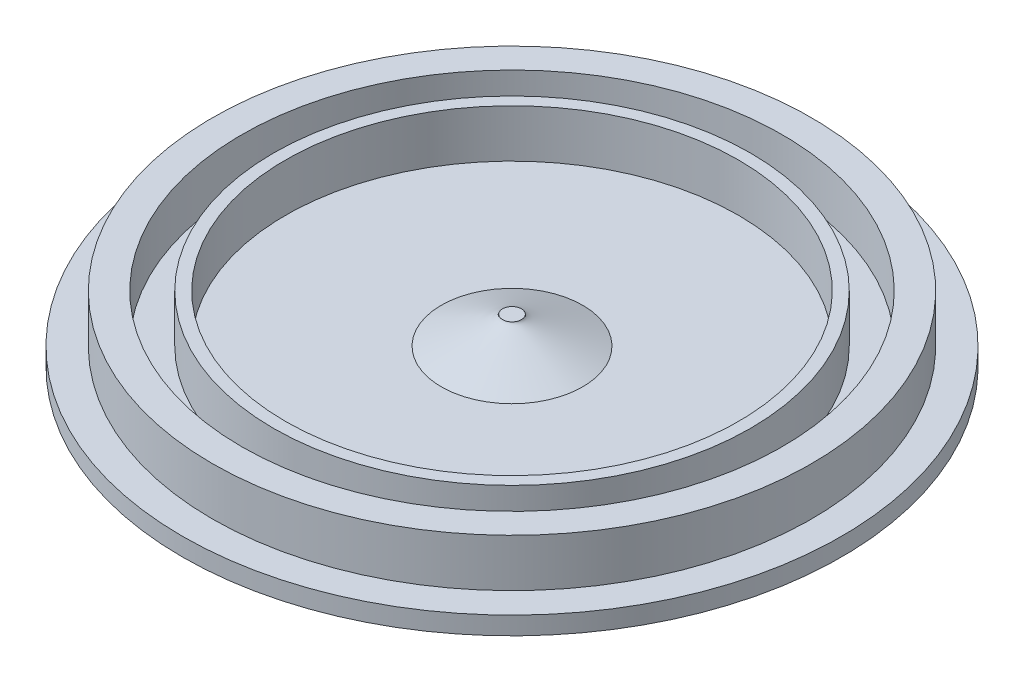
ISO-10303-21;
HEADER;
FILE_DESCRIPTION(('STEP AP214'),'2;1');
FILE_NAME('part.step','',(''),(''),'','','');
FILE_SCHEMA(('AUTOMOTIVE_DESIGN { 1 0 10303 214 1 1 1 1 }'));
ENDSEC;
DATA;
#1=APPLICATION_CONTEXT('core data for automotive mechanical design processes');
#2=APPLICATION_PROTOCOL_DEFINITION('international standard','automotive_design',2000,#1);
#3=PRODUCT_CONTEXT('',#1,'mechanical');
#4=PRODUCT('Part','Part','',(#3));
#5=PRODUCT_RELATED_PRODUCT_CATEGORY('part','',(#4));
#6=PRODUCT_DEFINITION_FORMATION('','',#4);
#7=PRODUCT_DEFINITION_CONTEXT('part definition',#1,'design');
#8=PRODUCT_DEFINITION('design','',#6,#7);
#9=PRODUCT_DEFINITION_SHAPE('','',#8);
#10=(LENGTH_UNIT() NAMED_UNIT(*) SI_UNIT(.MILLI.,.METRE.));
#11=(NAMED_UNIT(*) PLANE_ANGLE_UNIT() SI_UNIT($,.RADIAN.));
#12=(NAMED_UNIT(*) SI_UNIT($,.STERADIAN.) SOLID_ANGLE_UNIT());
#13=UNCERTAINTY_MEASURE_WITH_UNIT(LENGTH_MEASURE(1.E-05),#10,'distance_accuracy_value','');
#14=(GEOMETRIC_REPRESENTATION_CONTEXT(3) GLOBAL_UNCERTAINTY_ASSIGNED_CONTEXT((#13)) GLOBAL_UNIT_ASSIGNED_CONTEXT((#10,
#11,#12)) REPRESENTATION_CONTEXT('',''));
#15=CARTESIAN_POINT('',(0.,0.,0.));
#16=DIRECTION('',(0.,0.,1.));
#17=DIRECTION('',(1.,0.,0.));
#18=AXIS2_PLACEMENT_3D('',#15,#16,#17);
#19=CARTESIAN_POINT('',(0.,3.81,0.));
#20=DIRECTION('',(0.,1.,0.));
#21=DIRECTION('',(0.,0.,1.));
#22=AXIS2_PLACEMENT_3D('',#19,#20,#21);
#23=PLANE('',#22);
#24=CARTESIAN_POINT('',(0.,3.81,0.));
#25=DIRECTION('',(0.,1.,0.));
#26=DIRECTION('',(0.,0.,1.));
#27=AXIS2_PLACEMENT_3D('',#24,#25,#26);
#28=CIRCLE('',#27,48.006);
#29=CARTESIAN_POINT('',(0.,3.81,48.006));
#30=VERTEX_POINT('',#29);
#31=EDGE_CURVE('E11',#30,#30,#28,.F.);
#32=ORIENTED_EDGE('',*,*,#31,.F.);
#33=EDGE_LOOP('',(#32));
#34=FACE_BOUND('',#33,.T.);
#35=CARTESIAN_POINT('',(0.,3.81,0.));
#36=DIRECTION('',(0.,1.,0.));
#37=DIRECTION('',(0.,0.,1.));
#38=AXIS2_PLACEMENT_3D('',#35,#36,#37);
#39=CIRCLE('',#38,14.986);
#40=CARTESIAN_POINT('',(4.25324445277602,3.81,14.3697636593275));
#41=VERTEX_POINT('',#40);
#42=EDGE_CURVE('E73',#41,#41,#39,.T.);
#43=ORIENTED_EDGE('',*,*,#42,.F.);
#44=EDGE_LOOP('',(#43));
#45=FACE_BOUND('',#44,.T.);
#46=ADVANCED_FACE('F35',(#34,#45),#23,.T.);
#47=CARTESIAN_POINT('',(0.,3.81,0.));
#48=DIRECTION('',(0.,-1.,0.));
#49=DIRECTION('',(0.,0.,-1.));
#50=AXIS2_PLACEMENT_3D('',#47,#48,#49);
#51=CYLINDRICAL_SURFACE('',#50,69.85);
#52=CARTESIAN_POINT('',(0.,3.81,0.));
#53=DIRECTION('',(0.,1.,0.));
#54=DIRECTION('',(0.,0.,1.));
#55=AXIS2_PLACEMENT_3D('',#52,#53,#54);
#56=CIRCLE('',#55,69.85);
#57=CARTESIAN_POINT('',(0.,3.81,-69.85));
#58=VERTEX_POINT('',#57);
#59=EDGE_CURVE('E46',#58,#58,#56,.T.);
#60=CARTESIAN_POINT('',(0.,0.,0.));
#61=DIRECTION('',(0.,1.,0.));
#62=DIRECTION('',(0.,0.,1.));
#63=AXIS2_PLACEMENT_3D('',#60,#61,#62);
#64=CIRCLE('',#63,69.85);
#65=CARTESIAN_POINT('',(0.,0.,-69.85));
#66=VERTEX_POINT('',#65);
#67=EDGE_CURVE('E50',#66,#66,#64,.T.);
#68=CARTESIAN_POINT('',(0.,3.81,-69.85));
#69=CARTESIAN_POINT('',(0.,3.7703125,-69.85));
#70=CARTESIAN_POINT('',(0.,3.730625,-69.85));
#71=CARTESIAN_POINT('',(0.,3.65125,-69.85));
#72=CARTESIAN_POINT('',(0.,3.6115625,-69.85));
#73=CARTESIAN_POINT('',(0.,3.5321875,-69.85));
#74=CARTESIAN_POINT('',(0.,3.4925,-69.85));
#75=CARTESIAN_POINT('',(0.,3.413125,-69.85));
#76=CARTESIAN_POINT('',(0.,3.3734375,-69.85));
#77=CARTESIAN_POINT('',(0.,3.2940625,-69.85));
#78=CARTESIAN_POINT('',(0.,3.254375,-69.85));
#79=CARTESIAN_POINT('',(0.,3.175,-69.85));
#80=CARTESIAN_POINT('',(0.,3.1353125,-69.85));
#81=CARTESIAN_POINT('',(0.,3.0559375,-69.85));
#82=CARTESIAN_POINT('',(0.,3.01625,-69.85));
#83=CARTESIAN_POINT('',(0.,2.936875,-69.85));
#84=CARTESIAN_POINT('',(0.,2.8971875,-69.85));
#85=CARTESIAN_POINT('',(0.,2.8178125,-69.85));
#86=CARTESIAN_POINT('',(0.,2.778125,-69.85));
#87=CARTESIAN_POINT('',(0.,2.69875,-69.85));
#88=CARTESIAN_POINT('',(0.,2.6590625,-69.85));
#89=CARTESIAN_POINT('',(0.,2.5796875,-69.85));
#90=CARTESIAN_POINT('',(0.,2.54,-69.85));
#91=CARTESIAN_POINT('',(0.,2.460625,-69.85));
#92=CARTESIAN_POINT('',(0.,2.4209375,-69.85));
#93=CARTESIAN_POINT('',(0.,2.3415625,-69.85));
#94=CARTESIAN_POINT('',(0.,2.301875,-69.85));
#95=CARTESIAN_POINT('',(0.,2.2225,-69.85));
#96=CARTESIAN_POINT('',(0.,2.1828125,-69.85));
#97=CARTESIAN_POINT('',(0.,2.1034375,-69.85));
#98=CARTESIAN_POINT('',(0.,2.06375,-69.85));
#99=CARTESIAN_POINT('',(0.,1.984375,-69.85));
#100=CARTESIAN_POINT('',(0.,1.9446875,-69.85));
#101=CARTESIAN_POINT('',(0.,1.8653125,-69.85));
#102=CARTESIAN_POINT('',(0.,1.825625,-69.85));
#103=CARTESIAN_POINT('',(0.,1.74625,-69.85));
#104=CARTESIAN_POINT('',(0.,1.7065625,-69.85));
#105=CARTESIAN_POINT('',(0.,1.6271875,-69.85));
#106=CARTESIAN_POINT('',(0.,1.5875,-69.85));
#107=CARTESIAN_POINT('',(0.,1.508125,-69.85));
#108=CARTESIAN_POINT('',(0.,1.4684375,-69.85));
#109=CARTESIAN_POINT('',(0.,1.3890625,-69.85));
#110=CARTESIAN_POINT('',(0.,1.349375,-69.85));
#111=CARTESIAN_POINT('',(0.,1.27,-69.85));
#112=CARTESIAN_POINT('',(0.,1.2303125,-69.85));
#113=CARTESIAN_POINT('',(0.,1.1509375,-69.85));
#114=CARTESIAN_POINT('',(0.,1.11125,-69.85));
#115=CARTESIAN_POINT('',(0.,1.031875,-69.85));
#116=CARTESIAN_POINT('',(0.,0.9921875,-69.85));
#117=CARTESIAN_POINT('',(0.,0.9128125,-69.85));
#118=CARTESIAN_POINT('',(0.,0.873125,-69.85));
#119=CARTESIAN_POINT('',(0.,0.79375,-69.85));
#120=CARTESIAN_POINT('',(0.,0.7540625,-69.85));
#121=CARTESIAN_POINT('',(0.,0.6746875,-69.85));
#122=CARTESIAN_POINT('',(0.,0.635,-69.85));
#123=CARTESIAN_POINT('',(0.,0.555625,-69.85));
#124=CARTESIAN_POINT('',(0.,0.5159375,-69.85));
#125=CARTESIAN_POINT('',(0.,0.4365625,-69.85));
#126=CARTESIAN_POINT('',(0.,0.396875,-69.85));
#127=CARTESIAN_POINT('',(0.,0.3175,-69.85));
#128=CARTESIAN_POINT('',(0.,0.2778125,-69.85));
#129=CARTESIAN_POINT('',(0.,0.1984375,-69.85));
#130=CARTESIAN_POINT('',(0.,0.15875,-69.85));
#131=CARTESIAN_POINT('',(0.,0.0793749999999999,-69.85));
#132=CARTESIAN_POINT('',(0.,0.0396874999999999,-69.85));
#133=CARTESIAN_POINT('',(0.,0.,-69.85));
#134=B_SPLINE_CURVE_WITH_KNOTS('',3,(#68,#69,#70,#71,#72,#73,#74,#75,#76,#77,#78,#79,#80,#81,
#82,#83,#84,#85,#86,#87,#88,#89,#90,#91,#92,#93,#94,#95,#96,#97,#98,#99,#100,#101,#102,#103,
#104,#105,#106,#107,#108,#109,#110,#111,#112,#113,#114,#115,#116,#117,#118,#119,#120,#121,#122,
#123,#124,#125,#126,#127,#128,#129,#130,#131,#132,#133),.UNSPECIFIED.,.F.,.F.,(4,2,2,2,2,2,2,2,
2,2,2,2,2,2,2,2,2,2,2,2,2,2,2,2,2,2,2,2,2,2,2,2,4),(0.,0.1190625,0.238125,0.3571875,0.47625,
0.5953125,0.714375,0.8334375,0.9525,1.0715625,1.190625,1.3096875,1.42875,1.5478125,1.666875,
1.7859375,1.905,2.0240625,2.143125,2.2621875,2.38125,2.5003125,2.619375,2.7384375,2.8575,
2.9765625,3.095625,3.2146875,3.33375,3.4528125,3.571875,3.6909375,3.81),.UNSPECIFIED.);
#135=EDGE_CURVE('BSEAM37',#58,#66,#134,.T.);
#136=ORIENTED_EDGE('',*,*,#59,.F.);
#137=ORIENTED_EDGE('',*,*,#67,.T.);
#138=ORIENTED_EDGE('',*,*,#135,.T.);
#139=ORIENTED_EDGE('',*,*,#135,.F.);
#140=EDGE_LOOP('',(#136,#138,#137,#139));
#141=FACE_BOUND('',#140,.T.);
#142=ADVANCED_FACE('F37',(#141),#51,.T.);
#143=CARTESIAN_POINT('',(0.,3.81,0.));
#144=DIRECTION('',(0.,1.,0.));
#145=DIRECTION('',(0.,0.,1.));
#146=AXIS2_PLACEMENT_3D('',#143,#144,#145);
#147=CIRCLE('',#146,63.5);
#148=CARTESIAN_POINT('',(0.,3.81,63.5));
#149=VERTEX_POINT('',#148);
#150=EDGE_CURVE('E56',#149,#149,#147,.T.);
#151=ORIENTED_EDGE('',*,*,#150,.F.);
#152=EDGE_LOOP('',(#151));
#153=FACE_BOUND('',#152,.T.);
#154=ORIENTED_EDGE('',*,*,#59,.T.);
#155=EDGE_LOOP('',(#154));
#156=FACE_BOUND('',#155,.T.);
#157=ADVANCED_FACE('F126',(#153,#156),#23,.T.);
#158=CARTESIAN_POINT('',(0.,0.,0.));
#159=DIRECTION('',(0.,1.,0.));
#160=DIRECTION('',(0.,0.,1.));
#161=AXIS2_PLACEMENT_3D('',#158,#159,#160);
#162=PLANE('',#161);
#163=ORIENTED_EDGE('',*,*,#67,.F.);
#164=EDGE_LOOP('',(#163));
#165=FACE_BOUND('',#164,.T.);
#166=ADVANCED_FACE('F137',(#165),#162,.F.);
#167=CARTESIAN_POINT('',(0.,13.97,0.));
#168=DIRECTION('',(0.,1.,0.));
#169=DIRECTION('',(0.,0.,1.));
#170=AXIS2_PLACEMENT_3D('',#167,#168,#169);
#171=PLANE('',#170);
#172=CARTESIAN_POINT('',(0.,13.97,0.));
#173=DIRECTION('',(0.,1.,0.));
#174=DIRECTION('',(0.,0.,1.));
#175=AXIS2_PLACEMENT_3D('',#172,#173,#174);
#176=CIRCLE('',#175,63.5);
#177=CARTESIAN_POINT('',(0.,13.97,63.5));
#178=VERTEX_POINT('',#177);
#179=EDGE_CURVE('E54',#178,#178,#176,.T.);
#180=ORIENTED_EDGE('',*,*,#179,.T.);
#181=EDGE_LOOP('',(#180));
#182=FACE_BOUND('',#181,.T.);
#183=CARTESIAN_POINT('',(0.,13.97,0.));
#184=DIRECTION('',(0.,1.,0.));
#185=DIRECTION('',(0.,0.,1.));
#186=AXIS2_PLACEMENT_3D('',#183,#184,#185);
#187=CIRCLE('',#186,57.2897);
#188=CARTESIAN_POINT('',(0.,13.97,57.2897));
#189=VERTEX_POINT('',#188);
#190=EDGE_CURVE('E59',#189,#189,#187,.T.);
#191=ORIENTED_EDGE('',*,*,#190,.F.);
#192=EDGE_LOOP('',(#191));
#193=FACE_BOUND('',#192,.T.);
#194=ADVANCED_FACE('F142',(#182,#193),#171,.T.);
#195=CARTESIAN_POINT('',(0.,13.97,0.));
#196=DIRECTION('',(0.,-1.,0.));
#197=DIRECTION('',(0.,0.,-1.));
#198=AXIS2_PLACEMENT_3D('',#195,#196,#197);
#199=CYLINDRICAL_SURFACE('',#198,63.5);
#200=ORIENTED_EDGE('',*,*,#179,.F.);
#201=EDGE_LOOP('',(#200));
#202=FACE_BOUND('',#201,.T.);
#203=ORIENTED_EDGE('',*,*,#150,.T.);
#204=EDGE_LOOP('',(#203));
#205=FACE_BOUND('',#204,.T.);
#206=ADVANCED_FACE('F150',(#202,#205),#199,.T.);
#207=CARTESIAN_POINT('',(0.,13.97,0.));
#208=DIRECTION('',(0.,-1.,0.));
#209=DIRECTION('',(0.,0.,-1.));
#210=AXIS2_PLACEMENT_3D('',#207,#208,#209);
#211=CYLINDRICAL_SURFACE('',#210,57.2897);
#212=ORIENTED_EDGE('',*,*,#190,.T.);
#213=EDGE_LOOP('',(#212));
#214=FACE_BOUND('',#213,.T.);
#215=CARTESIAN_POINT('',(0.,3.81,0.));
#216=DIRECTION('',(0.,1.,0.));
#217=DIRECTION('',(0.,0.,1.));
#218=AXIS2_PLACEMENT_3D('',#215,#216,#217);
#219=CIRCLE('',#218,57.2897);
#220=CARTESIAN_POINT('',(0.,3.81,57.2897));
#221=VERTEX_POINT('',#220);
#222=EDGE_CURVE('E42',#221,#221,#219,.F.);
#223=ORIENTED_EDGE('',*,*,#222,.T.);
#224=EDGE_LOOP('',(#223));
#225=FACE_BOUND('',#224,.T.);
#226=ADVANCED_FACE('F134',(#214,#225),#211,.F.);
#227=CARTESIAN_POINT('',(0.,3.81,0.));
#228=DIRECTION('',(0.,1.,0.));
#229=DIRECTION('',(0.,0.,1.));
#230=AXIS2_PLACEMENT_3D('',#227,#228,#229);
#231=CIRCLE('',#230,50.546);
#232=CARTESIAN_POINT('',(0.,3.81,50.546));
#233=VERTEX_POINT('',#232);
#234=EDGE_CURVE('E65',#233,#233,#231,.T.);
#235=ORIENTED_EDGE('',*,*,#234,.F.);
#236=EDGE_LOOP('',(#235));
#237=FACE_BOUND('',#236,.T.);
#238=ORIENTED_EDGE('',*,*,#222,.F.);
#239=EDGE_LOOP('',(#238));
#240=FACE_BOUND('',#239,.T.);
#241=ADVANCED_FACE('F125',(#237,#240),#23,.T.);
#242=CARTESIAN_POINT('',(0.,13.97,0.));
#243=DIRECTION('',(0.,1.,0.));
#244=DIRECTION('',(0.,0.,1.));
#245=AXIS2_PLACEMENT_3D('',#242,#243,#244);
#246=PLANE('',#245);
#247=CARTESIAN_POINT('',(0.,13.97,0.));
#248=DIRECTION('',(0.,1.,0.));
#249=DIRECTION('',(0.,0.,1.));
#250=AXIS2_PLACEMENT_3D('',#247,#248,#249);
#251=CIRCLE('',#250,50.546);
#252=CARTESIAN_POINT('',(0.,13.97,50.546));
#253=VERTEX_POINT('',#252);
#254=EDGE_CURVE('E64',#253,#253,#251,.T.);
#255=ORIENTED_EDGE('',*,*,#254,.T.);
#256=EDGE_LOOP('',(#255));
#257=FACE_BOUND('',#256,.T.);
#258=CARTESIAN_POINT('',(0.,13.97,0.));
#259=DIRECTION('',(0.,1.,0.));
#260=DIRECTION('',(0.,0.,1.));
#261=AXIS2_PLACEMENT_3D('',#258,#259,#260);
#262=CIRCLE('',#261,48.006);
#263=CARTESIAN_POINT('',(0.,13.97,48.006));
#264=VERTEX_POINT('',#263);
#265=EDGE_CURVE('E68',#264,#264,#262,.T.);
#266=ORIENTED_EDGE('',*,*,#265,.F.);
#267=EDGE_LOOP('',(#266));
#268=FACE_BOUND('',#267,.T.);
#269=ADVANCED_FACE('F133',(#257,#268),#246,.T.);
#270=CARTESIAN_POINT('',(0.,13.97,0.));
#271=DIRECTION('',(0.,-1.,0.));
#272=DIRECTION('',(0.,0.,-1.));
#273=AXIS2_PLACEMENT_3D('',#270,#271,#272);
#274=CYLINDRICAL_SURFACE('',#273,50.546);
#275=ORIENTED_EDGE('',*,*,#254,.F.);
#276=EDGE_LOOP('',(#275));
#277=FACE_BOUND('',#276,.T.);
#278=ORIENTED_EDGE('',*,*,#234,.T.);
#279=EDGE_LOOP('',(#278));
#280=FACE_BOUND('',#279,.T.);
#281=ADVANCED_FACE('F163',(#277,#280),#274,.T.);
#282=CARTESIAN_POINT('',(0.,13.97,0.));
#283=DIRECTION('',(0.,-1.,0.));
#284=DIRECTION('',(0.,0.,-1.));
#285=AXIS2_PLACEMENT_3D('',#282,#283,#284);
#286=CYLINDRICAL_SURFACE('',#285,48.006);
#287=ORIENTED_EDGE('',*,*,#265,.T.);
#288=EDGE_LOOP('',(#287));
#289=FACE_BOUND('',#288,.T.);
#290=ORIENTED_EDGE('',*,*,#31,.T.);
#291=EDGE_LOOP('',(#290));
#292=FACE_BOUND('',#291,.T.);
#293=ADVANCED_FACE('F96',(#289,#292),#286,.F.);
#294=CARTESIAN_POINT('',(0.,9.652,0.));
#295=DIRECTION('',(0.,1.,0.));
#296=DIRECTION('',(0.,0.,1.));
#297=AXIS2_PLACEMENT_3D('',#294,#295,#296);
#298=PLANE('',#297);
#299=CARTESIAN_POINT('',(0.,9.652,0.));
#300=DIRECTION('',(0.,1.,0.));
#301=DIRECTION('',(0.,0.,1.));
#302=AXIS2_PLACEMENT_3D('',#299,#300,#301);
#303=CIRCLE('',#302,1.9939);
#304=CARTESIAN_POINT('',(-1.81569712491202,9.652,0.823942449802313));
#305=VERTEX_POINT('',#304);
#306=EDGE_CURVE('E76',#305,#305,#303,.T.);
#307=ORIENTED_EDGE('',*,*,#306,.T.);
#308=EDGE_LOOP('',(#307));
#309=FACE_BOUND('',#308,.T.);
#310=ADVANCED_FACE('F86',(#309),#298,.T.);
#311=CARTESIAN_POINT('',(-1.81569712491202,9.652,0.823942449802313));
#312=CARTESIAN_POINT('',(4.25324445277602,3.81,14.3697636593275));
#313=CARTESIAN_POINT('',(-3.46358202451664,9.652,-2.80745180002172));
#314=CARTESIAN_POINT('',(-24.4862828658791,3.81,22.8762525648796));
#315=CARTESIAN_POINT('',(0.16781222530739,9.652,-4.45533669962635));
#316=CARTESIAN_POINT('',(-32.9927717714311,3.81,-5.86327475377551));
#317=CARTESIAN_POINT('',(1.81569712491202,9.652,-0.823942449802313));
#318=CARTESIAN_POINT('',(-4.25324445277601,3.81,-14.3697636593275));
#319=CARTESIAN_POINT('',(3.46358202451664,9.652,2.80745180002172));
#320=CARTESIAN_POINT('',(24.486282865879,3.81,-22.8762525648795));
#321=CARTESIAN_POINT('',(-0.167812225307392,9.652,4.45533669962635));
#322=CARTESIAN_POINT('',(32.9927717714311,3.81,5.86327475377551));
#323=CARTESIAN_POINT('',(-1.81569712491202,9.652,0.823942449802313));
#324=CARTESIAN_POINT('',(4.25324445277602,3.81,14.3697636593275));
#325=(BOUNDED_SURFACE() B_SPLINE_SURFACE(3,1,((#311,#312),(#313,#314),(#315,#316),(#317,#318),
(#319,#320),(#321,#322),(#323,#324)),.UNSPECIFIED.,.T.,.F.,.F.) B_SPLINE_SURFACE_WITH_KNOTS((4,
3,4),(2,2),(0.,0.5,1.),(0.,1.),
.UNSPECIFIED.) GEOMETRIC_REPRESENTATION_ITEM() RATIONAL_B_SPLINE_SURFACE(((1.,1.),
(0.333333333333333,0.333333333333333),(0.333333333333333,0.333333333333333),(1.,1.),
(0.333333333333333,0.333333333333333),(0.333333333333333,0.333333333333333),(1.,1.))) REPRESENTATION_ITEM('') SURFACE());
#326=CARTESIAN_POINT('',(-1.81569712491202,9.652,0.823942449802313));
#327=CARTESIAN_POINT('',(-1.75247898347777,9.59114583333333,0.965044754068201));
#328=CARTESIAN_POINT('',(-1.68926084204352,9.53029166666667,1.10614705833409));
#329=CARTESIAN_POINT('',(-1.56282455917501,9.40858333333333,1.38835166686586));
#330=CARTESIAN_POINT('',(-1.49960641774076,9.34772916666667,1.52945397113175));
#331=CARTESIAN_POINT('',(-1.37317013487226,9.22602083333333,1.81165857966353));
#332=CARTESIAN_POINT('',(-1.30995199343801,9.16516666666667,1.95276088392941));
#333=CARTESIAN_POINT('',(-1.18351571056951,9.04345833333333,2.23496549246119));
#334=CARTESIAN_POINT('',(-1.12029756913526,8.98260416666666,2.37606779672708));
#335=CARTESIAN_POINT('',(-0.993861286266762,8.86089583333333,2.65827240525885));
#336=CARTESIAN_POINT('',(-0.930643144832511,8.80004166666667,2.79937470952474));
#337=CARTESIAN_POINT('',(-0.804206861964011,8.67833333333333,3.08157931805652));
#338=CARTESIAN_POINT('',(-0.740988720529761,8.61747916666667,3.2226816223224));
#339=CARTESIAN_POINT('',(-0.61455243766126,8.49577083333333,3.50488623085418));
#340=CARTESIAN_POINT('',(-0.551334296227009,8.43491666666666,3.64598853512007));
#341=CARTESIAN_POINT('',(-0.424898013358509,8.31320833333333,3.92819314365184));
#342=CARTESIAN_POINT('',(-0.361679871924258,8.25235416666667,4.06929544791773));
#343=CARTESIAN_POINT('',(-0.235243589055758,8.13064583333333,4.3515000564495));
#344=CARTESIAN_POINT('',(-0.172025447621507,8.06979166666666,4.49260236071539));
#345=CARTESIAN_POINT('',(-0.0455891647530067,7.94808333333333,4.77480696924717));
#346=CARTESIAN_POINT('',(0.0176289766812438,7.88722916666667,4.91590927351305));
#347=CARTESIAN_POINT('',(0.144065259549745,7.76552083333333,5.19811388204483));
#348=CARTESIAN_POINT('',(0.207283400983995,7.70466666666667,5.33921618631072));
#349=CARTESIAN_POINT('',(0.333719683852495,7.58295833333333,5.62142079484249));
#350=CARTESIAN_POINT('',(0.396937825286746,7.52210416666667,5.76252309910838));
#351=CARTESIAN_POINT('',(0.523374108155246,7.40039583333333,6.04472770764016));
#352=CARTESIAN_POINT('',(0.586592249589497,7.33954166666667,6.18583001190604));
#353=CARTESIAN_POINT('',(0.713028532457998,7.21783333333333,6.46803462043782));
#354=CARTESIAN_POINT('',(0.776246673892248,7.15697916666667,6.60913692470371));
#355=CARTESIAN_POINT('',(0.902682956760749,7.03527083333333,6.89134153323548));
#356=CARTESIAN_POINT('',(0.965901098194999,6.97441666666667,7.03244383750137));
#357=CARTESIAN_POINT('',(1.0923373810635,6.85270833333333,7.31464844603314));
#358=CARTESIAN_POINT('',(1.15555552249775,6.79185416666667,7.45575075029903));
#359=CARTESIAN_POINT('',(1.28199180536625,6.67014583333333,7.73795535883081));
#360=CARTESIAN_POINT('',(1.3452099468005,6.60929166666667,7.87905766309669));
#361=CARTESIAN_POINT('',(1.471646229669,6.48758333333333,8.16126227162847));
#362=CARTESIAN_POINT('',(1.53486437110325,6.42672916666667,8.30236457589436));
#363=CARTESIAN_POINT('',(1.66130065397175,6.30502083333333,8.58456918442613));
#364=CARTESIAN_POINT('',(1.724518795406,6.24416666666667,8.72567148869202));
#365=CARTESIAN_POINT('',(1.8509550782745,6.12245833333333,9.00787609722379));
#366=CARTESIAN_POINT('',(1.91417321970875,6.06160416666667,9.14897840148968));
#367=CARTESIAN_POINT('',(2.04060950257725,5.93989583333333,9.43118301002146));
#368=CARTESIAN_POINT('',(2.1038276440115,5.87904166666667,9.57228531428735));
#369=CARTESIAN_POINT('',(2.23026392688001,5.75733333333333,9.85448992281912));
#370=CARTESIAN_POINT('',(2.29348206831426,5.69647916666667,9.99559222708501));
#371=CARTESIAN_POINT('',(2.41991835118276,5.57477083333333,10.2777968356168));
#372=CARTESIAN_POINT('',(2.48313649261701,5.51391666666667,10.4188991398827));
#373=CARTESIAN_POINT('',(2.60957277548551,5.39220833333333,10.7011037484144));
#374=CARTESIAN_POINT('',(2.67279091691976,5.33135416666667,10.8422060526803));
#375=CARTESIAN_POINT('',(2.79922719978826,5.20964583333333,11.1244106612121));
#376=CARTESIAN_POINT('',(2.86244534122251,5.14879166666667,11.265512965478));
#377=CARTESIAN_POINT('',(2.98888162409101,5.02708333333333,11.5477175740098));
#378=CARTESIAN_POINT('',(3.05209976552526,4.96622916666667,11.6888198782757));
#379=CARTESIAN_POINT('',(3.17853604839376,4.84452083333333,11.9710244868074));
#380=CARTESIAN_POINT('',(3.24175418982801,4.78366666666667,12.1121267910733));
#381=CARTESIAN_POINT('',(3.36819047269651,4.66195833333333,12.3943313996051));
#382=CARTESIAN_POINT('',(3.43140861413076,4.60110416666667,12.535433703871));
#383=CARTESIAN_POINT('',(3.55784489699926,4.47939583333333,12.8176383124028));
#384=CARTESIAN_POINT('',(3.62106303843351,4.41854166666667,12.9587406166686));
#385=CARTESIAN_POINT('',(3.74749932130201,4.29683333333333,13.2409452252004));
#386=CARTESIAN_POINT('',(3.81071746273626,4.23597916666667,13.3820475294663));
#387=CARTESIAN_POINT('',(3.93715374560477,4.11427083333333,13.6642521379981));
#388=CARTESIAN_POINT('',(4.00037188703902,4.05341666666667,13.805354442264));
#389=CARTESIAN_POINT('',(4.12680816990752,3.93170833333333,14.0875590507958));
#390=CARTESIAN_POINT('',(4.19002631134177,3.87085416666667,14.2286613550616));
#391=CARTESIAN_POINT('',(4.25324445277602,3.81,14.3697636593275));
#392=B_SPLINE_CURVE_WITH_KNOTS('',3,(#326,#327,#328,#329,#330,#331,#332,#333,#334,#335,#336,
#337,#338,#339,#340,#341,#342,#343,#344,#345,#346,#347,#348,#349,#350,#351,#352,#353,#354,#355,
#356,#357,#358,#359,#360,#361,#362,#363,#364,#365,#366,#367,#368,#369,#370,#371,#372,#373,#374,
#375,#376,#377,#378,#379,#380,#381,#382,#383,#384,#385,#386,#387,#388,#389,#390,#391),
.UNSPECIFIED.,.F.,.F.,(4,2,2,2,2,2,2,2,2,2,2,2,2,2,2,2,2,2,2,2,2,2,2,2,2,2,2,2,2,2,2,2,4),(0.,
0.498484312176568,0.996968624353136,1.4954529365297,1.99393724870627,2.49242156088284,
2.99090587305941,3.48939018523598,3.98787449741254,4.48635880958911,4.98484312176568,
5.48332743394225,5.98181174611882,6.48029605829538,6.97878037047195,7.47726468264852,
7.97574899482509,8.47423330700165,8.97271761917822,9.47120193135479,9.96968624353136,
10.4681705557079,10.9666548678845,11.4651391800611,11.9636234922376,12.4621078044142,
12.9605921165908,13.4590764287673,13.9575607409439,14.4560450531205,14.954529365297,
15.4530136774736,15.9514979896502),.UNSPECIFIED.);
#393=EDGE_CURVE('BSEAM95',#305,#41,#392,.T.);
#394=ORIENTED_EDGE('',*,*,#306,.F.);
#395=ORIENTED_EDGE('',*,*,#42,.T.);
#396=ORIENTED_EDGE('',*,*,#393,.T.);
#397=ORIENTED_EDGE('',*,*,#393,.F.);
#398=EDGE_LOOP('',(#394,#396,#395,#397));
#399=FACE_BOUND('',#398,.T.);
#400=ADVANCED_FACE('F95',(#399),#325,.T.);
#401=CLOSED_SHELL('',(#46,#142,#157,#166,#194,#206,#226,#241,#269,#281,#293,#310,#400));
#402=MANIFOLD_SOLID_BREP('B2',#401);
#403=ADVANCED_BREP_SHAPE_REPRESENTATION('',(#18,#402),#14);
#404=SHAPE_DEFINITION_REPRESENTATION(#9,#403);
ENDSEC;
END-ISO-10303-21;
